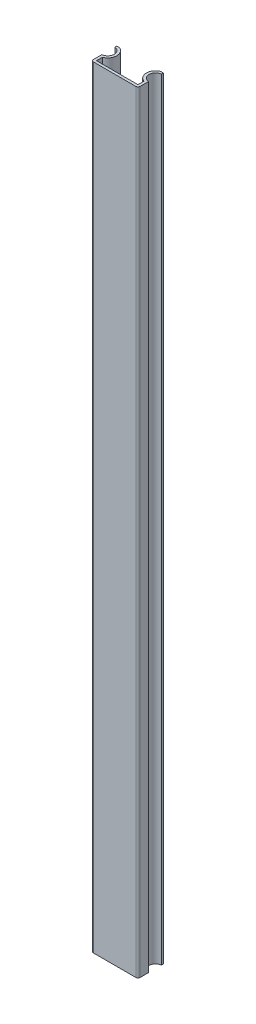
ISO-10303-21;
HEADER;
FILE_DESCRIPTION(('STEP AP214'),'2;1');
FILE_NAME('part.step','',(''),(''),'','','');
FILE_SCHEMA(('AUTOMOTIVE_DESIGN { 1 0 10303 214 1 1 1 1 }'));
ENDSEC;
DATA;
#1=APPLICATION_CONTEXT('core data for automotive mechanical design processes');
#2=APPLICATION_PROTOCOL_DEFINITION('international standard','automotive_design',2000,#1);
#3=PRODUCT_CONTEXT('',#1,'mechanical');
#4=PRODUCT('Part','Part','',(#3));
#5=PRODUCT_RELATED_PRODUCT_CATEGORY('part','',(#4));
#6=PRODUCT_DEFINITION_FORMATION('','',#4);
#7=PRODUCT_DEFINITION_CONTEXT('part definition',#1,'design');
#8=PRODUCT_DEFINITION('design','',#6,#7);
#9=PRODUCT_DEFINITION_SHAPE('','',#8);
#10=(LENGTH_UNIT() NAMED_UNIT(*) SI_UNIT(.MILLI.,.METRE.));
#11=(NAMED_UNIT(*) PLANE_ANGLE_UNIT() SI_UNIT($,.RADIAN.));
#12=(NAMED_UNIT(*) SI_UNIT($,.STERADIAN.) SOLID_ANGLE_UNIT());
#13=UNCERTAINTY_MEASURE_WITH_UNIT(LENGTH_MEASURE(1.E-05),#10,'distance_accuracy_value','');
#14=(GEOMETRIC_REPRESENTATION_CONTEXT(3) GLOBAL_UNCERTAINTY_ASSIGNED_CONTEXT((#13)) GLOBAL_UNIT_ASSIGNED_CONTEXT((#10,
#11,#12)) REPRESENTATION_CONTEXT('',''));
#15=CARTESIAN_POINT('',(0.,0.,0.));
#16=DIRECTION('',(0.,0.,1.));
#17=DIRECTION('',(1.,0.,0.));
#18=AXIS2_PLACEMENT_3D('',#15,#16,#17);
#19=CARTESIAN_POINT('',(-5.5,182.,0.));
#20=DIRECTION('',(1.,0.,0.));
#21=DIRECTION('',(0.,0.,-1.));
#22=AXIS2_PLACEMENT_3D('',#19,#20,#21);
#23=PLANE('',#22);
#24=DIRECTION('',(0.,0.,1.));
#25=VECTOR('',#24,1.);
#26=CARTESIAN_POINT('',(-5.5,0.,0.));
#27=LINE('',#26,#25);
#28=CARTESIAN_POINT('',(-5.5,0.,-2.47684537882722));
#29=VERTEX_POINT('',#28);
#30=CARTESIAN_POINT('',(-5.5,0.,-0.499999999999999));
#31=VERTEX_POINT('',#30);
#32=EDGE_CURVE('E190',#29,#31,#27,.T.);
#33=ORIENTED_EDGE('',*,*,#32,.T.);
#34=DIRECTION('',(0.,-1.,0.));
#35=VECTOR('',#34,1.);
#36=CARTESIAN_POINT('',(-5.5,182.,-0.499999999999999));
#37=LINE('',#36,#35);
#38=CARTESIAN_POINT('',(-5.5,182.,-0.499999999999999));
#39=VERTEX_POINT('',#38);
#40=EDGE_CURVE('E53',#31,#39,#37,.F.);
#41=ORIENTED_EDGE('',*,*,#40,.T.);
#42=DIRECTION('',(0.,0.,1.));
#43=VECTOR('',#42,1.);
#44=CARTESIAN_POINT('',(-5.5,182.,0.));
#45=LINE('',#44,#43);
#46=CARTESIAN_POINT('',(-5.5,182.,-2.47684537882722));
#47=VERTEX_POINT('',#46);
#48=EDGE_CURVE('E218',#47,#39,#45,.T.);
#49=ORIENTED_EDGE('',*,*,#48,.F.);
#50=DIRECTION('',(0.,-1.,0.));
#51=VECTOR('',#50,1.);
#52=CARTESIAN_POINT('',(-5.5,182.,-2.47684537882722));
#53=LINE('',#52,#51);
#54=EDGE_CURVE('E189',#47,#29,#53,.T.);
#55=ORIENTED_EDGE('',*,*,#54,.T.);
#56=EDGE_LOOP('',(#33,#41,#49,#55));
#57=FACE_BOUND('',#56,.T.);
#58=ADVANCED_FACE('F30',(#57),#23,.F.);
#59=CARTESIAN_POINT('',(5.5,182.,0.));
#60=DIRECTION('',(0.,0.,-1.));
#61=DIRECTION('',(-1.,0.,0.));
#62=AXIS2_PLACEMENT_3D('',#59,#60,#61);
#63=PLANE('',#62);
#64=DIRECTION('',(1.,0.,0.));
#65=VECTOR('',#64,1.);
#66=CARTESIAN_POINT('',(5.5,182.,0.));
#67=LINE('',#66,#65);
#68=CARTESIAN_POINT('',(-5.,182.,0.));
#69=VERTEX_POINT('',#68);
#70=CARTESIAN_POINT('',(5.,182.,0.));
#71=VERTEX_POINT('',#70);
#72=EDGE_CURVE('E151',#69,#71,#67,.T.);
#73=ORIENTED_EDGE('',*,*,#72,.F.);
#74=DIRECTION('',(0.,-1.,0.));
#75=VECTOR('',#74,1.);
#76=CARTESIAN_POINT('',(-5.,182.,0.));
#77=LINE('',#76,#75);
#78=CARTESIAN_POINT('',(-5.,0.,0.));
#79=VERTEX_POINT('',#78);
#80=EDGE_CURVE('E250',#69,#79,#77,.T.);
#81=ORIENTED_EDGE('',*,*,#80,.T.);
#82=DIRECTION('',(1.,0.,0.));
#83=VECTOR('',#82,1.);
#84=CARTESIAN_POINT('',(5.5,0.,0.));
#85=LINE('',#84,#83);
#86=CARTESIAN_POINT('',(5.,0.,0.));
#87=VERTEX_POINT('',#86);
#88=EDGE_CURVE('E192',#79,#87,#85,.T.);
#89=ORIENTED_EDGE('',*,*,#88,.T.);
#90=DIRECTION('',(0.,-1.,0.));
#91=VECTOR('',#90,1.);
#92=CARTESIAN_POINT('',(5.,182.,0.));
#93=LINE('',#92,#91);
#94=EDGE_CURVE('E160',#87,#71,#93,.F.);
#95=ORIENTED_EDGE('',*,*,#94,.T.);
#96=EDGE_LOOP('',(#73,#81,#89,#95));
#97=FACE_BOUND('',#96,.T.);
#98=ADVANCED_FACE('F263',(#97),#63,.F.);
#99=CARTESIAN_POINT('',(5.5,182.,0.));
#100=DIRECTION('',(-1.,0.,0.));
#101=DIRECTION('',(0.,0.,1.));
#102=AXIS2_PLACEMENT_3D('',#99,#100,#101);
#103=PLANE('',#102);
#104=DIRECTION('',(0.,0.,-1.));
#105=VECTOR('',#104,1.);
#106=CARTESIAN_POINT('',(5.5,182.,0.));
#107=LINE('',#106,#105);
#108=CARTESIAN_POINT('',(5.5,182.,-0.499999999999999));
#109=VERTEX_POINT('',#108);
#110=CARTESIAN_POINT('',(5.5,182.,-2.47684537882722));
#111=VERTEX_POINT('',#110);
#112=EDGE_CURVE('E143',#109,#111,#107,.T.);
#113=ORIENTED_EDGE('',*,*,#112,.F.);
#114=DIRECTION('',(0.,-1.,0.));
#115=VECTOR('',#114,1.);
#116=CARTESIAN_POINT('',(5.5,182.,-0.499999999999999));
#117=LINE('',#116,#115);
#118=CARTESIAN_POINT('',(5.5,0.,-0.499999999999999));
#119=VERTEX_POINT('',#118);
#120=EDGE_CURVE('E11',#109,#119,#117,.T.);
#121=ORIENTED_EDGE('',*,*,#120,.T.);
#122=DIRECTION('',(0.,0.,-1.));
#123=VECTOR('',#122,1.);
#124=CARTESIAN_POINT('',(5.5,0.,0.));
#125=LINE('',#124,#123);
#126=CARTESIAN_POINT('',(5.5,0.,-2.47684537882722));
#127=VERTEX_POINT('',#126);
#128=EDGE_CURVE('E157',#119,#127,#125,.T.);
#129=ORIENTED_EDGE('',*,*,#128,.T.);
#130=DIRECTION('',(0.,-1.,0.));
#131=VECTOR('',#130,1.);
#132=CARTESIAN_POINT('',(5.5,182.,-2.47684537882722));
#133=LINE('',#132,#131);
#134=EDGE_CURVE('E154',#111,#127,#133,.T.);
#135=ORIENTED_EDGE('',*,*,#134,.F.);
#136=EDGE_LOOP('',(#113,#121,#129,#135));
#137=FACE_BOUND('',#136,.T.);
#138=ADVANCED_FACE('F155',(#137),#103,.F.);
#139=CARTESIAN_POINT('',(5.62857142857143,182.,-4.));
#140=DIRECTION('',(0.,-1.,0.));
#141=DIRECTION('',(0.,0.,-1.));
#142=AXIS2_PLACEMENT_3D('',#139,#140,#141);
#143=CYLINDRICAL_SURFACE('',#142,1.52857142857143);
#144=CARTESIAN_POINT('',(5.62857142857143,0.,-4.));
#145=DIRECTION('',(0.,-1.,0.));
#146=DIRECTION('',(0.,0.,-1.));
#147=AXIS2_PLACEMENT_3D('',#144,#145,#146);
#148=CIRCLE('',#147,1.52857142857143);
#149=CARTESIAN_POINT('',(5.5,0.,-5.52315462117278));
#150=VERTEX_POINT('',#149);
#151=EDGE_CURVE('E196',#127,#150,#148,.T.);
#152=ORIENTED_EDGE('',*,*,#151,.T.);
#153=DIRECTION('',(0.,-1.,0.));
#154=VECTOR('',#153,1.);
#155=CARTESIAN_POINT('',(5.5,182.,-5.52315462117278));
#156=LINE('',#155,#154);
#157=CARTESIAN_POINT('',(5.5,182.,-5.52315462117278));
#158=VERTEX_POINT('',#157);
#159=EDGE_CURVE('E161',#158,#150,#156,.T.);
#160=ORIENTED_EDGE('',*,*,#159,.F.);
#161=CARTESIAN_POINT('',(5.62857142857143,182.,-4.));
#162=DIRECTION('',(0.,-1.,0.));
#163=DIRECTION('',(0.,0.,-1.));
#164=AXIS2_PLACEMENT_3D('',#161,#162,#163);
#165=CIRCLE('',#164,1.52857142857143);
#166=EDGE_CURVE('E147',#111,#158,#165,.T.);
#167=ORIENTED_EDGE('',*,*,#166,.F.);
#168=ORIENTED_EDGE('',*,*,#134,.T.);
#169=EDGE_LOOP('',(#152,#160,#167,#168));
#170=FACE_BOUND('',#169,.T.);
#171=ADVANCED_FACE('F163',(#170),#143,.F.);
#172=CARTESIAN_POINT('',(5.5,182.,-6.));
#173=DIRECTION('',(-1.,0.,0.));
#174=DIRECTION('',(0.,0.,1.));
#175=AXIS2_PLACEMENT_3D('',#172,#173,#174);
#176=PLANE('',#175);
#177=DIRECTION('',(0.,0.,-1.));
#178=VECTOR('',#177,1.);
#179=CARTESIAN_POINT('',(5.5,0.,-6.));
#180=LINE('',#179,#178);
#181=CARTESIAN_POINT('',(5.5,0.,-6.));
#182=VERTEX_POINT('',#181);
#183=EDGE_CURVE('E198',#150,#182,#180,.T.);
#184=ORIENTED_EDGE('',*,*,#183,.T.);
#185=DIRECTION('',(0.,-1.,0.));
#186=VECTOR('',#185,1.);
#187=CARTESIAN_POINT('',(5.5,182.,-6.));
#188=LINE('',#187,#186);
#189=CARTESIAN_POINT('',(5.5,182.,-6.));
#190=VERTEX_POINT('',#189);
#191=EDGE_CURVE('E245',#190,#182,#188,.T.);
#192=ORIENTED_EDGE('',*,*,#191,.F.);
#193=DIRECTION('',(0.,0.,-1.));
#194=VECTOR('',#193,1.);
#195=CARTESIAN_POINT('',(5.5,182.,-6.));
#196=LINE('',#195,#194);
#197=EDGE_CURVE('E166',#158,#190,#196,.T.);
#198=ORIENTED_EDGE('',*,*,#197,.F.);
#199=ORIENTED_EDGE('',*,*,#159,.T.);
#200=EDGE_LOOP('',(#184,#192,#198,#199));
#201=FACE_BOUND('',#200,.T.);
#202=ADVANCED_FACE('F318',(#201),#176,.F.);
#203=CARTESIAN_POINT('',(5.5,182.,-6.));
#204=DIRECTION('',(0.,0.,1.));
#205=DIRECTION('',(1.,0.,0.));
#206=AXIS2_PLACEMENT_3D('',#203,#204,#205);
#207=PLANE('',#206);
#208=DIRECTION('',(-1.,0.,0.));
#209=VECTOR('',#208,1.);
#210=CARTESIAN_POINT('',(5.5,0.,-6.));
#211=LINE('',#210,#209);
#212=CARTESIAN_POINT('',(4.9,0.,-6.));
#213=VERTEX_POINT('',#212);
#214=EDGE_CURVE('E200',#182,#213,#211,.T.);
#215=ORIENTED_EDGE('',*,*,#214,.T.);
#216=DIRECTION('',(0.,-1.,0.));
#217=VECTOR('',#216,1.);
#218=CARTESIAN_POINT('',(4.9,182.,-6.));
#219=LINE('',#218,#217);
#220=CARTESIAN_POINT('',(4.9,182.,-6.));
#221=VERTEX_POINT('',#220);
#222=EDGE_CURVE('E242',#221,#213,#219,.T.);
#223=ORIENTED_EDGE('',*,*,#222,.F.);
#224=DIRECTION('',(-1.,0.,0.));
#225=VECTOR('',#224,1.);
#226=CARTESIAN_POINT('',(5.5,182.,-6.));
#227=LINE('',#226,#225);
#228=EDGE_CURVE('E168',#190,#221,#227,.T.);
#229=ORIENTED_EDGE('',*,*,#228,.F.);
#230=ORIENTED_EDGE('',*,*,#191,.T.);
#231=EDGE_LOOP('',(#215,#223,#229,#230));
#232=FACE_BOUND('',#231,.T.);
#233=ADVANCED_FACE('F315',(#232),#207,.F.);
#234=CARTESIAN_POINT('',(5.62857142857143,182.,-4.));
#235=DIRECTION('',(0.,-1.,0.));
#236=DIRECTION('',(0.,0.,-1.));
#237=AXIS2_PLACEMENT_3D('',#234,#235,#236);
#238=CYLINDRICAL_SURFACE('',#237,2.12857142857143);
#239=CARTESIAN_POINT('',(5.62857142857143,0.,-4.));
#240=DIRECTION('',(0.,1.,0.));
#241=DIRECTION('',(0.,0.,-1.));
#242=AXIS2_PLACEMENT_3D('',#239,#240,#241);
#243=CIRCLE('',#242,2.12857142857143);
#244=CARTESIAN_POINT('',(4.9,0.,-2.));
#245=VERTEX_POINT('',#244);
#246=EDGE_CURVE('E202',#213,#245,#243,.T.);
#247=ORIENTED_EDGE('',*,*,#246,.T.);
#248=DIRECTION('',(0.,-1.,0.));
#249=VECTOR('',#248,1.);
#250=CARTESIAN_POINT('',(4.9,182.,-2.));
#251=LINE('',#250,#249);
#252=CARTESIAN_POINT('',(4.9,182.,-2.));
#253=VERTEX_POINT('',#252);
#254=EDGE_CURVE('E239',#253,#245,#251,.T.);
#255=ORIENTED_EDGE('',*,*,#254,.F.);
#256=CARTESIAN_POINT('',(5.62857142857143,182.,-4.));
#257=DIRECTION('',(0.,1.,0.));
#258=DIRECTION('',(0.,0.,-1.));
#259=AXIS2_PLACEMENT_3D('',#256,#257,#258);
#260=CIRCLE('',#259,2.12857142857143);
#261=EDGE_CURVE('E173',#221,#253,#260,.T.);
#262=ORIENTED_EDGE('',*,*,#261,.F.);
#263=ORIENTED_EDGE('',*,*,#222,.T.);
#264=EDGE_LOOP('',(#247,#255,#262,#263));
#265=FACE_BOUND('',#264,.T.);
#266=ADVANCED_FACE('F310',(#265),#238,.T.);
#267=CARTESIAN_POINT('',(4.9,182.,-0.599999999999999));
#268=DIRECTION('',(1.,0.,0.));
#269=DIRECTION('',(0.,0.,-1.));
#270=AXIS2_PLACEMENT_3D('',#267,#268,#269);
#271=PLANE('',#270);
#272=DIRECTION('',(0.,0.,1.));
#273=VECTOR('',#272,1.);
#274=CARTESIAN_POINT('',(4.9,0.,-0.599999999999999));
#275=LINE('',#274,#273);
#276=CARTESIAN_POINT('',(4.9,0.,-0.599999999999999));
#277=VERTEX_POINT('',#276);
#278=EDGE_CURVE('E204',#245,#277,#275,.T.);
#279=ORIENTED_EDGE('',*,*,#278,.T.);
#280=DIRECTION('',(0.,-1.,0.));
#281=VECTOR('',#280,1.);
#282=CARTESIAN_POINT('',(4.9,182.,-0.599999999999999));
#283=LINE('',#282,#281);
#284=CARTESIAN_POINT('',(4.9,182.,-0.599999999999999));
#285=VERTEX_POINT('',#284);
#286=EDGE_CURVE('E236',#285,#277,#283,.T.);
#287=ORIENTED_EDGE('',*,*,#286,.F.);
#288=DIRECTION('',(0.,0.,1.));
#289=VECTOR('',#288,1.);
#290=CARTESIAN_POINT('',(4.9,182.,-0.599999999999999));
#291=LINE('',#290,#289);
#292=EDGE_CURVE('E175',#253,#285,#291,.T.);
#293=ORIENTED_EDGE('',*,*,#292,.F.);
#294=ORIENTED_EDGE('',*,*,#254,.T.);
#295=EDGE_LOOP('',(#279,#287,#293,#294));
#296=FACE_BOUND('',#295,.T.);
#297=ADVANCED_FACE('F304',(#296),#271,.F.);
#298=CARTESIAN_POINT('',(4.9,182.,-0.599999999999999));
#299=DIRECTION('',(0.,0.,1.));
#300=DIRECTION('',(1.,0.,0.));
#301=AXIS2_PLACEMENT_3D('',#298,#299,#300);
#302=PLANE('',#301);
#303=DIRECTION('',(-1.,0.,0.));
#304=VECTOR('',#303,1.);
#305=CARTESIAN_POINT('',(4.9,0.,-0.599999999999999));
#306=LINE('',#305,#304);
#307=CARTESIAN_POINT('',(-4.9,0.,-0.599999999999999));
#308=VERTEX_POINT('',#307);
#309=EDGE_CURVE('E206',#277,#308,#306,.T.);
#310=ORIENTED_EDGE('',*,*,#309,.T.);
#311=DIRECTION('',(0.,-1.,0.));
#312=VECTOR('',#311,1.);
#313=CARTESIAN_POINT('',(-4.9,182.,-0.599999999999999));
#314=LINE('',#313,#312);
#315=CARTESIAN_POINT('',(-4.9,182.,-0.599999999999999));
#316=VERTEX_POINT('',#315);
#317=EDGE_CURVE('E233',#316,#308,#314,.T.);
#318=ORIENTED_EDGE('',*,*,#317,.F.);
#319=DIRECTION('',(-1.,0.,0.));
#320=VECTOR('',#319,1.);
#321=CARTESIAN_POINT('',(4.9,182.,-0.599999999999999));
#322=LINE('',#321,#320);
#323=EDGE_CURVE('E177',#285,#316,#322,.T.);
#324=ORIENTED_EDGE('',*,*,#323,.F.);
#325=ORIENTED_EDGE('',*,*,#286,.T.);
#326=EDGE_LOOP('',(#310,#318,#324,#325));
#327=FACE_BOUND('',#326,.T.);
#328=ADVANCED_FACE('F300',(#327),#302,.F.);
#329=CARTESIAN_POINT('',(-4.9,182.,-0.599999999999999));
#330=DIRECTION('',(-1.,0.,0.));
#331=DIRECTION('',(0.,0.,1.));
#332=AXIS2_PLACEMENT_3D('',#329,#330,#331);
#333=PLANE('',#332);
#334=DIRECTION('',(0.,0.,-1.));
#335=VECTOR('',#334,1.);
#336=CARTESIAN_POINT('',(-4.9,0.,-0.599999999999999));
#337=LINE('',#336,#335);
#338=CARTESIAN_POINT('',(-4.9,0.,-2.));
#339=VERTEX_POINT('',#338);
#340=EDGE_CURVE('E208',#308,#339,#337,.T.);
#341=ORIENTED_EDGE('',*,*,#340,.T.);
#342=DIRECTION('',(0.,-1.,0.));
#343=VECTOR('',#342,1.);
#344=CARTESIAN_POINT('',(-4.9,182.,-2.));
#345=LINE('',#344,#343);
#346=CARTESIAN_POINT('',(-4.9,182.,-2.));
#347=VERTEX_POINT('',#346);
#348=EDGE_CURVE('E230',#347,#339,#345,.T.);
#349=ORIENTED_EDGE('',*,*,#348,.F.);
#350=DIRECTION('',(0.,0.,-1.));
#351=VECTOR('',#350,1.);
#352=CARTESIAN_POINT('',(-4.9,182.,-0.599999999999999));
#353=LINE('',#352,#351);
#354=EDGE_CURVE('E179',#316,#347,#353,.T.);
#355=ORIENTED_EDGE('',*,*,#354,.F.);
#356=ORIENTED_EDGE('',*,*,#317,.T.);
#357=EDGE_LOOP('',(#341,#349,#355,#356));
#358=FACE_BOUND('',#357,.T.);
#359=ADVANCED_FACE('F295',(#358),#333,.F.);
#360=CARTESIAN_POINT('',(-5.62857142857143,182.,-4.));
#361=DIRECTION('',(0.,-1.,0.));
#362=DIRECTION('',(0.,0.,-1.));
#363=AXIS2_PLACEMENT_3D('',#360,#361,#362);
#364=CYLINDRICAL_SURFACE('',#363,2.12857142857143);
#365=CARTESIAN_POINT('',(-5.62857142857143,0.,-4.));
#366=DIRECTION('',(0.,1.,0.));
#367=DIRECTION('',(0.,0.,1.));
#368=AXIS2_PLACEMENT_3D('',#365,#366,#367);
#369=CIRCLE('',#368,2.12857142857143);
#370=CARTESIAN_POINT('',(-4.9,0.,-6.));
#371=VERTEX_POINT('',#370);
#372=EDGE_CURVE('E210',#339,#371,#369,.T.);
#373=ORIENTED_EDGE('',*,*,#372,.T.);
#374=DIRECTION('',(0.,-1.,0.));
#375=VECTOR('',#374,1.);
#376=CARTESIAN_POINT('',(-4.9,182.,-6.));
#377=LINE('',#376,#375);
#378=CARTESIAN_POINT('',(-4.9,182.,-6.));
#379=VERTEX_POINT('',#378);
#380=EDGE_CURVE('E227',#379,#371,#377,.T.);
#381=ORIENTED_EDGE('',*,*,#380,.F.);
#382=CARTESIAN_POINT('',(-5.62857142857143,182.,-4.));
#383=DIRECTION('',(0.,1.,0.));
#384=DIRECTION('',(0.,0.,1.));
#385=AXIS2_PLACEMENT_3D('',#382,#383,#384);
#386=CIRCLE('',#385,2.12857142857143);
#387=EDGE_CURVE('E181',#347,#379,#386,.T.);
#388=ORIENTED_EDGE('',*,*,#387,.F.);
#389=ORIENTED_EDGE('',*,*,#348,.T.);
#390=EDGE_LOOP('',(#373,#381,#388,#389));
#391=FACE_BOUND('',#390,.T.);
#392=ADVANCED_FACE('F289',(#391),#364,.T.);
#393=CARTESIAN_POINT('',(-5.5,182.,-6.));
#394=DIRECTION('',(0.,0.,1.));
#395=DIRECTION('',(1.,0.,0.));
#396=AXIS2_PLACEMENT_3D('',#393,#394,#395);
#397=PLANE('',#396);
#398=DIRECTION('',(-1.,0.,0.));
#399=VECTOR('',#398,1.);
#400=CARTESIAN_POINT('',(-5.5,0.,-6.));
#401=LINE('',#400,#399);
#402=CARTESIAN_POINT('',(-5.5,0.,-6.));
#403=VERTEX_POINT('',#402);
#404=EDGE_CURVE('E212',#371,#403,#401,.T.);
#405=ORIENTED_EDGE('',*,*,#404,.T.);
#406=DIRECTION('',(0.,-1.,0.));
#407=VECTOR('',#406,1.);
#408=CARTESIAN_POINT('',(-5.5,182.,-6.));
#409=LINE('',#408,#407);
#410=CARTESIAN_POINT('',(-5.5,182.,-6.));
#411=VERTEX_POINT('',#410);
#412=EDGE_CURVE('E224',#411,#403,#409,.T.);
#413=ORIENTED_EDGE('',*,*,#412,.F.);
#414=DIRECTION('',(-1.,0.,0.));
#415=VECTOR('',#414,1.);
#416=CARTESIAN_POINT('',(-5.5,182.,-6.));
#417=LINE('',#416,#415);
#418=EDGE_CURVE('E183',#379,#411,#417,.T.);
#419=ORIENTED_EDGE('',*,*,#418,.F.);
#420=ORIENTED_EDGE('',*,*,#380,.T.);
#421=EDGE_LOOP('',(#405,#413,#419,#420));
#422=FACE_BOUND('',#421,.T.);
#423=ADVANCED_FACE('F285',(#422),#397,.F.);
#424=CARTESIAN_POINT('',(-5.5,182.,-6.));
#425=DIRECTION('',(1.,0.,0.));
#426=DIRECTION('',(0.,0.,-1.));
#427=AXIS2_PLACEMENT_3D('',#424,#425,#426);
#428=PLANE('',#427);
#429=DIRECTION('',(0.,0.,1.));
#430=VECTOR('',#429,1.);
#431=CARTESIAN_POINT('',(-5.5,0.,-6.));
#432=LINE('',#431,#430);
#433=CARTESIAN_POINT('',(-5.5,0.,-5.52315462117278));
#434=VERTEX_POINT('',#433);
#435=EDGE_CURVE('E214',#403,#434,#432,.T.);
#436=ORIENTED_EDGE('',*,*,#435,.T.);
#437=DIRECTION('',(0.,-1.,0.));
#438=VECTOR('',#437,1.);
#439=CARTESIAN_POINT('',(-5.5,182.,-5.52315462117278));
#440=LINE('',#439,#438);
#441=CARTESIAN_POINT('',(-5.5,182.,-5.52315462117278));
#442=VERTEX_POINT('',#441);
#443=EDGE_CURVE('E221',#442,#434,#440,.T.);
#444=ORIENTED_EDGE('',*,*,#443,.F.);
#445=DIRECTION('',(0.,0.,1.));
#446=VECTOR('',#445,1.);
#447=CARTESIAN_POINT('',(-5.5,182.,-6.));
#448=LINE('',#447,#446);
#449=EDGE_CURVE('E185',#411,#442,#448,.T.);
#450=ORIENTED_EDGE('',*,*,#449,.F.);
#451=ORIENTED_EDGE('',*,*,#412,.T.);
#452=EDGE_LOOP('',(#436,#444,#450,#451));
#453=FACE_BOUND('',#452,.T.);
#454=ADVANCED_FACE('F280',(#453),#428,.F.);
#455=CARTESIAN_POINT('',(-5.62857142857143,182.,-4.));
#456=DIRECTION('',(0.,-1.,0.));
#457=DIRECTION('',(0.,0.,-1.));
#458=AXIS2_PLACEMENT_3D('',#455,#456,#457);
#459=CYLINDRICAL_SURFACE('',#458,1.52857142857143);
#460=CARTESIAN_POINT('',(-5.62857142857143,0.,-4.));
#461=DIRECTION('',(0.,-1.,0.));
#462=DIRECTION('',(0.,0.,1.));
#463=AXIS2_PLACEMENT_3D('',#460,#461,#462);
#464=CIRCLE('',#463,1.52857142857143);
#465=EDGE_CURVE('E216',#434,#29,#464,.T.);
#466=ORIENTED_EDGE('',*,*,#465,.T.);
#467=ORIENTED_EDGE('',*,*,#54,.F.);
#468=CARTESIAN_POINT('',(-5.62857142857143,182.,-4.));
#469=DIRECTION('',(0.,-1.,0.));
#470=DIRECTION('',(0.,0.,1.));
#471=AXIS2_PLACEMENT_3D('',#468,#469,#470);
#472=CIRCLE('',#471,1.52857142857143);
#473=EDGE_CURVE('E187',#442,#47,#472,.T.);
#474=ORIENTED_EDGE('',*,*,#473,.F.);
#475=ORIENTED_EDGE('',*,*,#443,.T.);
#476=EDGE_LOOP('',(#466,#467,#474,#475));
#477=FACE_BOUND('',#476,.T.);
#478=ADVANCED_FACE('F274',(#477),#459,.F.);
#479=CARTESIAN_POINT('',(-5.62857142857143,182.,-4.));
#480=DIRECTION('',(0.,1.,0.));
#481=DIRECTION('',(0.,0.,1.));
#482=AXIS2_PLACEMENT_3D('',#479,#480,#481);
#483=PLANE('',#482);
#484=ORIENTED_EDGE('',*,*,#48,.T.);
#485=CARTESIAN_POINT('',(-5.,182.,-0.499999999999998));
#486=DIRECTION('',(0.,1.,0.));
#487=DIRECTION('',(0.,0.,1.));
#488=AXIS2_PLACEMENT_3D('',#485,#486,#487);
#489=CIRCLE('',#488,0.5);
#490=EDGE_CURVE('E38',#39,#69,#489,.T.);
#491=ORIENTED_EDGE('',*,*,#490,.T.);
#492=ORIENTED_EDGE('',*,*,#72,.T.);
#493=CARTESIAN_POINT('',(5.,182.,-0.499999999999998));
#494=DIRECTION('',(0.,1.,0.));
#495=DIRECTION('',(0.,0.,1.));
#496=AXIS2_PLACEMENT_3D('',#493,#494,#495);
#497=CIRCLE('',#496,0.5);
#498=EDGE_CURVE('E45',#71,#109,#497,.T.);
#499=ORIENTED_EDGE('',*,*,#498,.T.);
#500=ORIENTED_EDGE('',*,*,#112,.T.);
#501=ORIENTED_EDGE('',*,*,#166,.T.);
#502=ORIENTED_EDGE('',*,*,#197,.T.);
#503=ORIENTED_EDGE('',*,*,#228,.T.);
#504=ORIENTED_EDGE('',*,*,#261,.T.);
#505=ORIENTED_EDGE('',*,*,#292,.T.);
#506=ORIENTED_EDGE('',*,*,#323,.T.);
#507=ORIENTED_EDGE('',*,*,#354,.T.);
#508=ORIENTED_EDGE('',*,*,#387,.T.);
#509=ORIENTED_EDGE('',*,*,#418,.T.);
#510=ORIENTED_EDGE('',*,*,#449,.T.);
#511=ORIENTED_EDGE('',*,*,#473,.T.);
#512=EDGE_LOOP('',(#484,#491,#492,#499,#500,#501,#502,#503,#504,#505,#506,#507,#508,#509,#510,#511));
#513=FACE_BOUND('',#512,.T.);
#514=ADVANCED_FACE('F145',(#513),#483,.T.);
#515=CARTESIAN_POINT('',(-5.62857142857143,0.,-4.));
#516=DIRECTION('',(0.,1.,0.));
#517=DIRECTION('',(0.,0.,1.));
#518=AXIS2_PLACEMENT_3D('',#515,#516,#517);
#519=PLANE('',#518);
#520=ORIENTED_EDGE('',*,*,#88,.F.);
#521=CARTESIAN_POINT('',(-5.,0.,-0.499999999999998));
#522=DIRECTION('',(0.,1.,0.));
#523=DIRECTION('',(0.,0.,1.));
#524=AXIS2_PLACEMENT_3D('',#521,#522,#523);
#525=CIRCLE('',#524,0.5);
#526=EDGE_CURVE('E255',#79,#31,#525,.F.);
#527=ORIENTED_EDGE('',*,*,#526,.T.);
#528=ORIENTED_EDGE('',*,*,#32,.F.);
#529=ORIENTED_EDGE('',*,*,#465,.F.);
#530=ORIENTED_EDGE('',*,*,#435,.F.);
#531=ORIENTED_EDGE('',*,*,#404,.F.);
#532=ORIENTED_EDGE('',*,*,#372,.F.);
#533=ORIENTED_EDGE('',*,*,#340,.F.);
#534=ORIENTED_EDGE('',*,*,#309,.F.);
#535=ORIENTED_EDGE('',*,*,#278,.F.);
#536=ORIENTED_EDGE('',*,*,#246,.F.);
#537=ORIENTED_EDGE('',*,*,#214,.F.);
#538=ORIENTED_EDGE('',*,*,#183,.F.);
#539=ORIENTED_EDGE('',*,*,#151,.F.);
#540=ORIENTED_EDGE('',*,*,#128,.F.);
#541=CARTESIAN_POINT('',(5.,0.,-0.499999999999998));
#542=DIRECTION('',(0.,1.,0.));
#543=DIRECTION('',(0.,0.,1.));
#544=AXIS2_PLACEMENT_3D('',#541,#542,#543);
#545=CIRCLE('',#544,0.5);
#546=EDGE_CURVE('E253',#119,#87,#545,.F.);
#547=ORIENTED_EDGE('',*,*,#546,.T.);
#548=EDGE_LOOP('',(#520,#527,#528,#529,#530,#531,#532,#533,#534,#535,#536,#537,#538,#539,#540,#547));
#549=FACE_BOUND('',#548,.T.);
#550=ADVANCED_FACE('F269',(#549),#519,.F.);
#551=CARTESIAN_POINT('',(-5.,182.,-0.499999999999998));
#552=DIRECTION('',(0.,-1.,0.));
#553=DIRECTION('',(0.,0.,-1.));
#554=AXIS2_PLACEMENT_3D('',#551,#552,#553);
#555=CYLINDRICAL_SURFACE('',#554,0.5);
#556=ORIENTED_EDGE('',*,*,#490,.F.);
#557=ORIENTED_EDGE('',*,*,#40,.F.);
#558=ORIENTED_EDGE('',*,*,#526,.F.);
#559=ORIENTED_EDGE('',*,*,#80,.F.);
#560=EDGE_LOOP('',(#556,#557,#558,#559));
#561=FACE_BOUND('',#560,.T.);
#562=ADVANCED_FACE('F266',(#561),#555,.T.);
#563=CARTESIAN_POINT('',(5.,182.,-0.499999999999998));
#564=DIRECTION('',(0.,-1.,0.));
#565=DIRECTION('',(0.,0.,-1.));
#566=AXIS2_PLACEMENT_3D('',#563,#564,#565);
#567=CYLINDRICAL_SURFACE('',#566,0.5);
#568=ORIENTED_EDGE('',*,*,#498,.F.);
#569=ORIENTED_EDGE('',*,*,#94,.F.);
#570=ORIENTED_EDGE('',*,*,#546,.F.);
#571=ORIENTED_EDGE('',*,*,#120,.F.);
#572=EDGE_LOOP('',(#568,#569,#570,#571));
#573=FACE_BOUND('',#572,.T.);
#574=ADVANCED_FACE('F32',(#573),#567,.T.);
#575=CLOSED_SHELL('',(#58,#98,#138,#171,#202,#233,#266,#297,#328,#359,#392,#423,#454,#478,#514,
#550,#562,#574));
#576=MANIFOLD_SOLID_BREP('B2',#575);
#577=ADVANCED_BREP_SHAPE_REPRESENTATION('',(#18,#576),#14);
#578=SHAPE_DEFINITION_REPRESENTATION(#9,#577);
ENDSEC;
END-ISO-10303-21;
